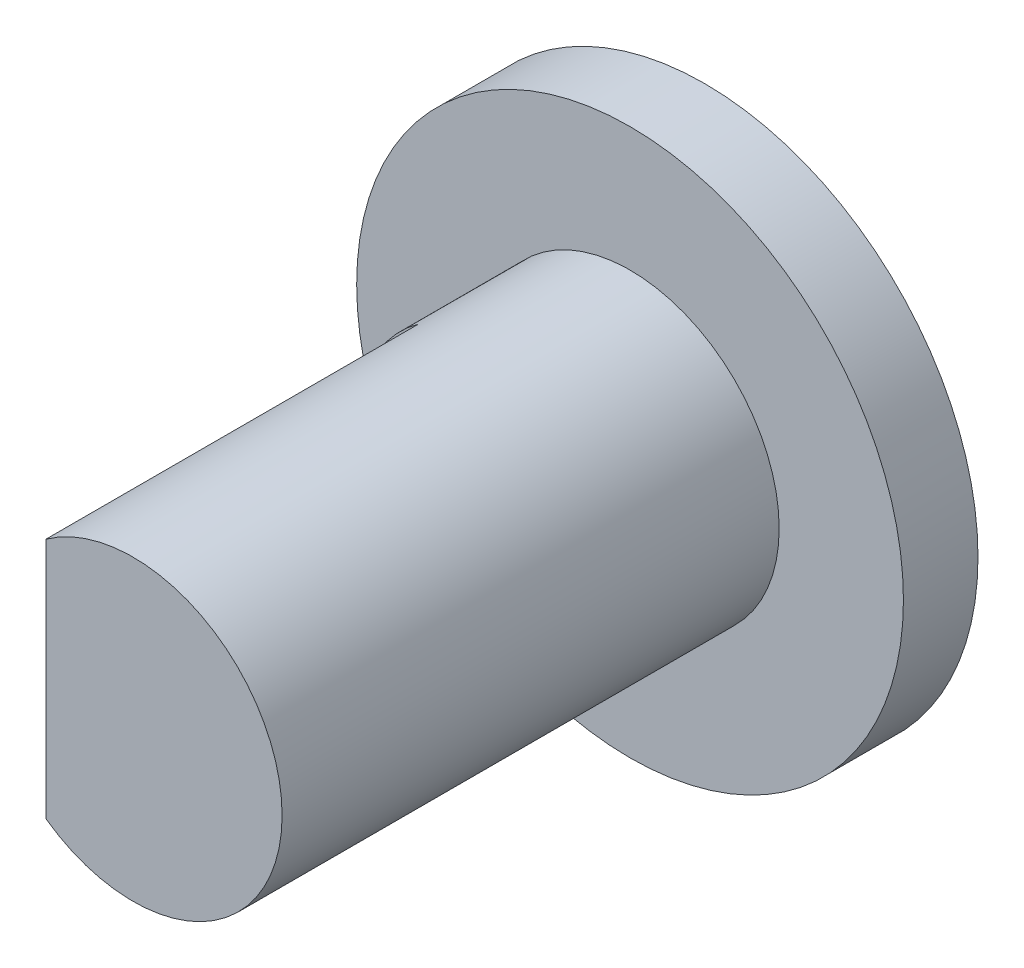
ISO-10303-21;
HEADER;
FILE_DESCRIPTION(('STEP AP214'),'2;1');
FILE_NAME('part.step','',(''),(''),'','','');
FILE_SCHEMA(('AUTOMOTIVE_DESIGN { 1 0 10303 214 1 1 1 1 }'));
ENDSEC;
DATA;
#1=APPLICATION_CONTEXT('core data for automotive mechanical design processes');
#2=APPLICATION_PROTOCOL_DEFINITION('international standard','automotive_design',2000,#1);
#3=PRODUCT_CONTEXT('',#1,'mechanical');
#4=PRODUCT('Part','Part','',(#3));
#5=PRODUCT_RELATED_PRODUCT_CATEGORY('part','',(#4));
#6=PRODUCT_DEFINITION_FORMATION('','',#4);
#7=PRODUCT_DEFINITION_CONTEXT('part definition',#1,'design');
#8=PRODUCT_DEFINITION('design','',#6,#7);
#9=PRODUCT_DEFINITION_SHAPE('','',#8);
#10=(LENGTH_UNIT() NAMED_UNIT(*) SI_UNIT(.MILLI.,.METRE.));
#11=(NAMED_UNIT(*) PLANE_ANGLE_UNIT() SI_UNIT($,.RADIAN.));
#12=(NAMED_UNIT(*) SI_UNIT($,.STERADIAN.) SOLID_ANGLE_UNIT());
#13=UNCERTAINTY_MEASURE_WITH_UNIT(LENGTH_MEASURE(1.E-05),#10,'distance_accuracy_value','');
#14=(GEOMETRIC_REPRESENTATION_CONTEXT(3) GLOBAL_UNCERTAINTY_ASSIGNED_CONTEXT((#13)) GLOBAL_UNIT_ASSIGNED_CONTEXT((#10,
#11,#12)) REPRESENTATION_CONTEXT('',''));
#15=CARTESIAN_POINT('',(0.,0.,0.));
#16=DIRECTION('',(0.,0.,1.));
#17=DIRECTION('',(1.,0.,0.));
#18=AXIS2_PLACEMENT_3D('',#15,#16,#17);
#19=CARTESIAN_POINT('',(0.,0.,3.));
#20=DIRECTION('',(0.,0.,-1.));
#21=DIRECTION('',(-1.,0.,0.));
#22=AXIS2_PLACEMENT_3D('',#19,#20,#21);
#23=CYLINDRICAL_SURFACE('',#22,11.);
#24=CARTESIAN_POINT('',(0.,0.,3.));
#25=DIRECTION('',(0.,0.,1.));
#26=DIRECTION('',(1.,0.,0.));
#27=AXIS2_PLACEMENT_3D('',#24,#25,#26);
#28=CIRCLE('',#27,11.);
#29=CARTESIAN_POINT('',(11.,0.,3.));
#30=VERTEX_POINT('',#29);
#31=EDGE_CURVE('E45',#30,#30,#28,.T.);
#32=ORIENTED_EDGE('',*,*,#31,.F.);
#33=EDGE_LOOP('',(#32));
#34=FACE_BOUND('',#33,.T.);
#35=CARTESIAN_POINT('',(0.,0.,0.));
#36=DIRECTION('',(0.,0.,1.));
#37=DIRECTION('',(1.,0.,0.));
#38=AXIS2_PLACEMENT_3D('',#35,#36,#37);
#39=CIRCLE('',#38,11.);
#40=CARTESIAN_POINT('',(11.,0.,0.));
#41=VERTEX_POINT('',#40);
#42=EDGE_CURVE('E40',#41,#41,#39,.T.);
#43=ORIENTED_EDGE('',*,*,#42,.T.);
#44=EDGE_LOOP('',(#43));
#45=FACE_BOUND('',#44,.T.);
#46=ADVANCED_FACE('F37',(#34,#45),#23,.T.);
#47=CARTESIAN_POINT('',(0.,0.,3.));
#48=DIRECTION('',(0.,0.,1.));
#49=DIRECTION('',(1.,0.,0.));
#50=AXIS2_PLACEMENT_3D('',#47,#48,#49);
#51=PLANE('',#50);
#52=CARTESIAN_POINT('',(0.,0.,3.));
#53=DIRECTION('',(0.,0.,1.));
#54=DIRECTION('',(1.,0.,0.));
#55=AXIS2_PLACEMENT_3D('',#52,#53,#54);
#56=CIRCLE('',#55,6.);
#57=CARTESIAN_POINT('',(6.,0.,3.));
#58=VERTEX_POINT('',#57);
#59=EDGE_CURVE('E11',#58,#58,#56,.T.);
#60=ORIENTED_EDGE('',*,*,#59,.F.);
#61=EDGE_LOOP('',(#60));
#62=FACE_BOUND('',#61,.T.);
#63=ORIENTED_EDGE('',*,*,#31,.T.);
#64=EDGE_LOOP('',(#63));
#65=FACE_BOUND('',#64,.T.);
#66=ADVANCED_FACE('F84',(#62,#65),#51,.T.);
#67=CARTESIAN_POINT('',(0.,0.,0.));
#68=DIRECTION('',(0.,0.,1.));
#69=DIRECTION('',(1.,0.,0.));
#70=AXIS2_PLACEMENT_3D('',#67,#68,#69);
#71=PLANE('',#70);
#72=ORIENTED_EDGE('',*,*,#42,.F.);
#73=EDGE_LOOP('',(#72));
#74=FACE_BOUND('',#73,.T.);
#75=ADVANCED_FACE('F90',(#74),#71,.F.);
#76=CARTESIAN_POINT('',(0.,0.,23.));
#77=DIRECTION('',(0.,0.,-1.));
#78=DIRECTION('',(-1.,0.,0.));
#79=AXIS2_PLACEMENT_3D('',#76,#77,#78);
#80=CYLINDRICAL_SURFACE('',#79,6.);
#81=CARTESIAN_POINT('',(0.,0.,23.));
#82=DIRECTION('',(0.,0.,1.));
#83=DIRECTION('',(1.,0.,0.));
#84=AXIS2_PLACEMENT_3D('',#81,#82,#83);
#85=CIRCLE('',#84,6.);
#86=CARTESIAN_POINT('',(-3.5,-4.87339717240448,23.));
#87=VERTEX_POINT('',#86);
#88=CARTESIAN_POINT('',(-3.5,4.87339717240448,23.));
#89=VERTEX_POINT('',#88);
#90=EDGE_CURVE('E75',#87,#89,#85,.T.);
#91=ORIENTED_EDGE('',*,*,#90,.F.);
#92=DIRECTION('',(0.,0.,1.));
#93=VECTOR('',#92,1.);
#94=CARTESIAN_POINT('',(-3.5,-4.87339717240448,8.));
#95=LINE('',#94,#93);
#96=CARTESIAN_POINT('',(-3.5,-4.87339717240448,8.));
#97=VERTEX_POINT('',#96);
#98=EDGE_CURVE('E53',#97,#87,#95,.T.);
#99=ORIENTED_EDGE('',*,*,#98,.F.);
#100=CARTESIAN_POINT('',(0.,0.,8.));
#101=DIRECTION('',(0.,0.,1.));
#102=DIRECTION('',(1.,0.,0.));
#103=AXIS2_PLACEMENT_3D('',#100,#101,#102);
#104=CIRCLE('',#103,6.);
#105=CARTESIAN_POINT('',(-3.5,4.87339717240448,8.));
#106=VERTEX_POINT('',#105);
#107=EDGE_CURVE('E69',#106,#97,#104,.T.);
#108=ORIENTED_EDGE('',*,*,#107,.F.);
#109=DIRECTION('',(0.,0.,1.));
#110=VECTOR('',#109,1.);
#111=CARTESIAN_POINT('',(-3.5,4.87339717240448,8.));
#112=LINE('',#111,#110);
#113=EDGE_CURVE('E59',#106,#89,#112,.T.);
#114=ORIENTED_EDGE('',*,*,#113,.T.);
#115=EDGE_LOOP('',(#91,#99,#108,#114));
#116=FACE_BOUND('',#115,.T.);
#117=ORIENTED_EDGE('',*,*,#59,.T.);
#118=EDGE_LOOP('',(#117));
#119=FACE_BOUND('',#118,.T.);
#120=ADVANCED_FACE('F73',(#116,#119),#80,.T.);
#121=CARTESIAN_POINT('',(0.,0.,23.));
#122=DIRECTION('',(0.,0.,1.));
#123=DIRECTION('',(1.,0.,0.));
#124=AXIS2_PLACEMENT_3D('',#121,#122,#123);
#125=PLANE('',#124);
#126=DIRECTION('',(0.,1.,0.));
#127=VECTOR('',#126,1.);
#128=CARTESIAN_POINT('',(-3.5,4.87339717240448,23.));
#129=LINE('',#128,#127);
#130=EDGE_CURVE('E64',#87,#89,#129,.T.);
#131=ORIENTED_EDGE('',*,*,#130,.F.);
#132=ORIENTED_EDGE('',*,*,#90,.T.);
#133=EDGE_LOOP('',(#131,#132));
#134=FACE_BOUND('',#133,.T.);
#135=ADVANCED_FACE('F77',(#134),#125,.T.);
#136=CARTESIAN_POINT('',(-3.5,4.87339717240448,8.));
#137=DIRECTION('',(1.,0.,0.));
#138=DIRECTION('',(0.,0.,-1.));
#139=AXIS2_PLACEMENT_3D('',#136,#137,#138);
#140=PLANE('',#139);
#141=ORIENTED_EDGE('',*,*,#130,.T.);
#142=ORIENTED_EDGE('',*,*,#113,.F.);
#143=DIRECTION('',(0.,1.,0.));
#144=VECTOR('',#143,1.);
#145=CARTESIAN_POINT('',(-3.5,4.87339717240448,8.));
#146=LINE('',#145,#144);
#147=EDGE_CURVE('E109',#97,#106,#146,.T.);
#148=ORIENTED_EDGE('',*,*,#147,.F.);
#149=ORIENTED_EDGE('',*,*,#98,.T.);
#150=EDGE_LOOP('',(#141,#142,#148,#149));
#151=FACE_BOUND('',#150,.T.);
#152=ADVANCED_FACE('F65',(#151),#140,.F.);
#153=CARTESIAN_POINT('',(0.,0.,8.));
#154=DIRECTION('',(0.,0.,1.));
#155=DIRECTION('',(1.,0.,0.));
#156=AXIS2_PLACEMENT_3D('',#153,#154,#155);
#157=PLANE('',#156);
#158=ORIENTED_EDGE('',*,*,#107,.T.);
#159=ORIENTED_EDGE('',*,*,#147,.T.);
#160=EDGE_LOOP('',(#158,#159));
#161=FACE_BOUND('',#160,.T.);
#162=ADVANCED_FACE('F104',(#161),#157,.T.);
#163=CLOSED_SHELL('',(#46,#66,#75,#120,#135,#152,#162));
#164=MANIFOLD_SOLID_BREP('B2',#163);
#165=ADVANCED_BREP_SHAPE_REPRESENTATION('',(#18,#164),#14);
#166=SHAPE_DEFINITION_REPRESENTATION(#9,#165);
ENDSEC;
END-ISO-10303-21;
